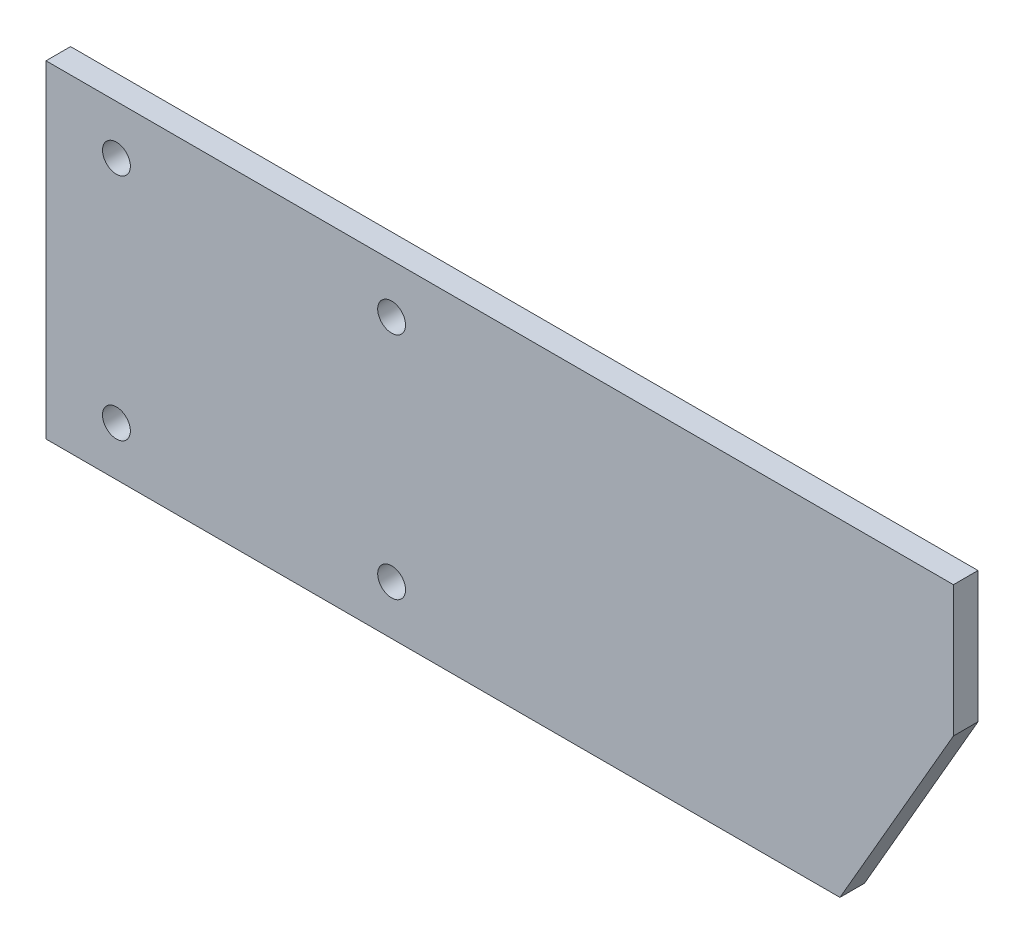
ISO-10303-21;
HEADER;
FILE_DESCRIPTION(('STEP AP214'),'2;1');
FILE_NAME('part.step','',(''),(''),'','','');
FILE_SCHEMA(('AUTOMOTIVE_DESIGN { 1 0 10303 214 1 1 1 1 }'));
ENDSEC;
DATA;
#1=APPLICATION_CONTEXT('core data for automotive mechanical design processes');
#2=APPLICATION_PROTOCOL_DEFINITION('international standard','automotive_design',2000,#1);
#3=PRODUCT_CONTEXT('',#1,'mechanical');
#4=PRODUCT('Part','Part','',(#3));
#5=PRODUCT_RELATED_PRODUCT_CATEGORY('part','',(#4));
#6=PRODUCT_DEFINITION_FORMATION('','',#4);
#7=PRODUCT_DEFINITION_CONTEXT('part definition',#1,'design');
#8=PRODUCT_DEFINITION('design','',#6,#7);
#9=PRODUCT_DEFINITION_SHAPE('','',#8);
#10=(LENGTH_UNIT() NAMED_UNIT(*) SI_UNIT(.MILLI.,.METRE.));
#11=(NAMED_UNIT(*) PLANE_ANGLE_UNIT() SI_UNIT($,.RADIAN.));
#12=(NAMED_UNIT(*) SI_UNIT($,.STERADIAN.) SOLID_ANGLE_UNIT());
#13=UNCERTAINTY_MEASURE_WITH_UNIT(LENGTH_MEASURE(1.E-05),#10,'distance_accuracy_value','');
#14=(GEOMETRIC_REPRESENTATION_CONTEXT(3) GLOBAL_UNCERTAINTY_ASSIGNED_CONTEXT((#13)) GLOBAL_UNIT_ASSIGNED_CONTEXT((#10,
#11,#12)) REPRESENTATION_CONTEXT('',''));
#15=CARTESIAN_POINT('',(0.,0.,0.));
#16=DIRECTION('',(0.,0.,1.));
#17=DIRECTION('',(1.,0.,0.));
#18=AXIS2_PLACEMENT_3D('',#15,#16,#17);
#19=CARTESIAN_POINT('',(-127.,-100.,15.));
#20=DIRECTION('',(0.,0.,1.));
#21=DIRECTION('',(1.,0.,0.));
#22=AXIS2_PLACEMENT_3D('',#19,#20,#21);
#23=PLANE('',#22);
#24=CARTESIAN_POINT('',(84.,-70.,15.));
#25=DIRECTION('',(0.,0.,1.));
#26=DIRECTION('',(1.,0.,0.));
#27=AXIS2_PLACEMENT_3D('',#24,#25,#26);
#28=CIRCLE('',#27,8.49999999999999);
#29=CARTESIAN_POINT('',(92.5,-70.,15.));
#30=VERTEX_POINT('',#29);
#31=EDGE_CURVE('E172',#30,#30,#28,.T.);
#32=ORIENTED_EDGE('',*,*,#31,.F.);
#33=EDGE_LOOP('',(#32));
#34=FACE_BOUND('',#33,.T.);
#35=CARTESIAN_POINT('',(-84.,70.,15.));
#36=DIRECTION('',(0.,0.,1.));
#37=DIRECTION('',(1.,0.,0.));
#38=AXIS2_PLACEMENT_3D('',#35,#36,#37);
#39=CIRCLE('',#38,8.50000000000001);
#40=CARTESIAN_POINT('',(-75.5,70.,15.));
#41=VERTEX_POINT('',#40);
#42=EDGE_CURVE('E111',#41,#41,#39,.T.);
#43=ORIENTED_EDGE('',*,*,#42,.F.);
#44=EDGE_LOOP('',(#43));
#45=FACE_BOUND('',#44,.T.);
#46=DIRECTION('',(0.,-1.,0.));
#47=VECTOR('',#46,1.);
#48=CARTESIAN_POINT('',(-127.,100.,15.));
#49=LINE('',#48,#47);
#50=CARTESIAN_POINT('',(-127.,100.,15.));
#51=VERTEX_POINT('',#50);
#52=CARTESIAN_POINT('',(-127.,-100.,15.));
#53=VERTEX_POINT('',#52);
#54=EDGE_CURVE('E116',#51,#53,#49,.T.);
#55=ORIENTED_EDGE('',*,*,#54,.T.);
#56=DIRECTION('',(1.,0.,0.));
#57=VECTOR('',#56,1.);
#58=CARTESIAN_POINT('',(-127.,-100.,15.));
#59=LINE('',#58,#57);
#60=CARTESIAN_POINT('',(357.717967697245,-100.,15.));
#61=VERTEX_POINT('',#60);
#62=EDGE_CURVE('E83',#53,#61,#59,.T.);
#63=ORIENTED_EDGE('',*,*,#62,.T.);
#64=DIRECTION('',(0.499999999999998,0.86602540378444,0.));
#65=VECTOR('',#64,1.);
#66=CARTESIAN_POINT('',(357.717967697245,-100.,15.));
#67=LINE('',#66,#65);
#68=CARTESIAN_POINT('',(427.,20.,15.));
#69=VERTEX_POINT('',#68);
#70=EDGE_CURVE('E87',#61,#69,#67,.T.);
#71=ORIENTED_EDGE('',*,*,#70,.T.);
#72=DIRECTION('',(0.,1.,0.));
#73=VECTOR('',#72,1.);
#74=CARTESIAN_POINT('',(427.,20.,15.));
#75=LINE('',#74,#73);
#76=CARTESIAN_POINT('',(427.,100.,15.));
#77=VERTEX_POINT('',#76);
#78=EDGE_CURVE('E91',#69,#77,#75,.T.);
#79=ORIENTED_EDGE('',*,*,#78,.T.);
#80=DIRECTION('',(-1.,0.,0.));
#81=VECTOR('',#80,1.);
#82=CARTESIAN_POINT('',(-127.,100.,15.));
#83=LINE('',#82,#81);
#84=EDGE_CURVE('E49',#77,#51,#83,.T.);
#85=ORIENTED_EDGE('',*,*,#84,.T.);
#86=EDGE_LOOP('',(#55,#63,#71,#79,#85));
#87=FACE_BOUND('',#86,.T.);
#88=CARTESIAN_POINT('',(84.,70.,15.));
#89=DIRECTION('',(0.,0.,1.));
#90=DIRECTION('',(1.,0.,0.));
#91=AXIS2_PLACEMENT_3D('',#88,#89,#90);
#92=CIRCLE('',#91,8.49999999999999);
#93=CARTESIAN_POINT('',(92.5,70.,15.));
#94=VERTEX_POINT('',#93);
#95=EDGE_CURVE('E178',#94,#94,#92,.T.);
#96=ORIENTED_EDGE('',*,*,#95,.F.);
#97=EDGE_LOOP('',(#96));
#98=FACE_BOUND('',#97,.T.);
#99=CARTESIAN_POINT('',(-84.,-70.,15.));
#100=DIRECTION('',(0.,0.,1.));
#101=DIRECTION('',(1.,0.,0.));
#102=AXIS2_PLACEMENT_3D('',#99,#100,#101);
#103=CIRCLE('',#102,8.50000000000001);
#104=CARTESIAN_POINT('',(-75.5,-70.,15.));
#105=VERTEX_POINT('',#104);
#106=EDGE_CURVE('E163',#105,#105,#103,.T.);
#107=ORIENTED_EDGE('',*,*,#106,.F.);
#108=EDGE_LOOP('',(#107));
#109=FACE_BOUND('',#108,.T.);
#110=ADVANCED_FACE('F32',(#34,#45,#87,#98,#109),#23,.T.);
#111=CARTESIAN_POINT('',(-127.,-100.,0.));
#112=DIRECTION('',(0.,0.,1.));
#113=DIRECTION('',(1.,0.,0.));
#114=AXIS2_PLACEMENT_3D('',#111,#112,#113);
#115=PLANE('',#114);
#116=CARTESIAN_POINT('',(84.,-70.,0.));
#117=DIRECTION('',(0.,0.,1.));
#118=DIRECTION('',(1.,0.,0.));
#119=AXIS2_PLACEMENT_3D('',#116,#117,#118);
#120=CIRCLE('',#119,8.49999999999999);
#121=CARTESIAN_POINT('',(92.5,-70.,0.));
#122=VERTEX_POINT('',#121);
#123=EDGE_CURVE('E169',#122,#122,#120,.T.);
#124=ORIENTED_EDGE('',*,*,#123,.T.);
#125=EDGE_LOOP('',(#124));
#126=FACE_BOUND('',#125,.T.);
#127=CARTESIAN_POINT('',(-84.,70.,0.));
#128=DIRECTION('',(0.,0.,1.));
#129=DIRECTION('',(1.,0.,0.));
#130=AXIS2_PLACEMENT_3D('',#127,#128,#129);
#131=CIRCLE('',#130,8.50000000000001);
#132=CARTESIAN_POINT('',(-75.5,70.,0.));
#133=VERTEX_POINT('',#132);
#134=EDGE_CURVE('E181',#133,#133,#131,.T.);
#135=ORIENTED_EDGE('',*,*,#134,.T.);
#136=EDGE_LOOP('',(#135));
#137=FACE_BOUND('',#136,.T.);
#138=DIRECTION('',(0.,-1.,0.));
#139=VECTOR('',#138,1.);
#140=CARTESIAN_POINT('',(-127.,100.,0.));
#141=LINE('',#140,#139);
#142=CARTESIAN_POINT('',(-127.,100.,0.));
#143=VERTEX_POINT('',#142);
#144=CARTESIAN_POINT('',(-127.,-100.,0.));
#145=VERTEX_POINT('',#144);
#146=EDGE_CURVE('E107',#143,#145,#141,.T.);
#147=ORIENTED_EDGE('',*,*,#146,.F.);
#148=DIRECTION('',(-1.,0.,0.));
#149=VECTOR('',#148,1.);
#150=CARTESIAN_POINT('',(-127.,100.,0.));
#151=LINE('',#150,#149);
#152=CARTESIAN_POINT('',(427.,100.,0.));
#153=VERTEX_POINT('',#152);
#154=EDGE_CURVE('E75',#153,#143,#151,.T.);
#155=ORIENTED_EDGE('',*,*,#154,.F.);
#156=DIRECTION('',(0.,1.,0.));
#157=VECTOR('',#156,1.);
#158=CARTESIAN_POINT('',(427.,20.,0.));
#159=LINE('',#158,#157);
#160=CARTESIAN_POINT('',(427.,20.,0.));
#161=VERTEX_POINT('',#160);
#162=EDGE_CURVE('E69',#161,#153,#159,.T.);
#163=ORIENTED_EDGE('',*,*,#162,.F.);
#164=DIRECTION('',(0.499999999999998,0.86602540378444,0.));
#165=VECTOR('',#164,1.);
#166=CARTESIAN_POINT('',(357.717967697245,-100.,0.));
#167=LINE('',#166,#165);
#168=CARTESIAN_POINT('',(357.717967697245,-100.,0.));
#169=VERTEX_POINT('',#168);
#170=EDGE_CURVE('E98',#169,#161,#167,.T.);
#171=ORIENTED_EDGE('',*,*,#170,.F.);
#172=DIRECTION('',(1.,0.,0.));
#173=VECTOR('',#172,1.);
#174=CARTESIAN_POINT('',(-127.,-100.,0.));
#175=LINE('',#174,#173);
#176=EDGE_CURVE('E110',#145,#169,#175,.T.);
#177=ORIENTED_EDGE('',*,*,#176,.F.);
#178=EDGE_LOOP('',(#147,#155,#163,#171,#177));
#179=FACE_BOUND('',#178,.T.);
#180=CARTESIAN_POINT('',(84.,70.,0.));
#181=DIRECTION('',(0.,0.,1.));
#182=DIRECTION('',(1.,0.,0.));
#183=AXIS2_PLACEMENT_3D('',#180,#181,#182);
#184=CIRCLE('',#183,8.49999999999999);
#185=CARTESIAN_POINT('',(92.5,70.,0.));
#186=VERTEX_POINT('',#185);
#187=EDGE_CURVE('E175',#186,#186,#184,.T.);
#188=ORIENTED_EDGE('',*,*,#187,.T.);
#189=EDGE_LOOP('',(#188));
#190=FACE_BOUND('',#189,.T.);
#191=CARTESIAN_POINT('',(-84.,-70.,0.));
#192=DIRECTION('',(0.,0.,1.));
#193=DIRECTION('',(1.,0.,0.));
#194=AXIS2_PLACEMENT_3D('',#191,#192,#193);
#195=CIRCLE('',#194,8.50000000000001);
#196=CARTESIAN_POINT('',(-75.5,-70.,0.));
#197=VERTEX_POINT('',#196);
#198=EDGE_CURVE('E166',#197,#197,#195,.T.);
#199=ORIENTED_EDGE('',*,*,#198,.T.);
#200=EDGE_LOOP('',(#199));
#201=FACE_BOUND('',#200,.T.);
#202=ADVANCED_FACE('F120',(#126,#137,#179,#190,#201),#115,.F.);
#203=CARTESIAN_POINT('',(-127.,100.,15.));
#204=DIRECTION('',(1.,0.,0.));
#205=DIRECTION('',(0.,1.,0.));
#206=AXIS2_PLACEMENT_3D('',#203,#204,#205);
#207=PLANE('',#206);
#208=ORIENTED_EDGE('',*,*,#146,.T.);
#209=DIRECTION('',(0.,0.,-1.));
#210=VECTOR('',#209,1.);
#211=CARTESIAN_POINT('',(-127.,-100.,15.));
#212=LINE('',#211,#210);
#213=EDGE_CURVE('E11',#53,#145,#212,.T.);
#214=ORIENTED_EDGE('',*,*,#213,.F.);
#215=ORIENTED_EDGE('',*,*,#54,.F.);
#216=DIRECTION('',(0.,0.,-1.));
#217=VECTOR('',#216,1.);
#218=CARTESIAN_POINT('',(-127.,100.,15.));
#219=LINE('',#218,#217);
#220=EDGE_CURVE('E103',#51,#143,#219,.T.);
#221=ORIENTED_EDGE('',*,*,#220,.T.);
#222=EDGE_LOOP('',(#208,#214,#215,#221));
#223=FACE_BOUND('',#222,.T.);
#224=ADVANCED_FACE('F34',(#223),#207,.F.);
#225=CARTESIAN_POINT('',(-127.,-100.,15.));
#226=DIRECTION('',(0.,1.,0.));
#227=DIRECTION('',(0.,0.,1.));
#228=AXIS2_PLACEMENT_3D('',#225,#226,#227);
#229=PLANE('',#228);
#230=ORIENTED_EDGE('',*,*,#176,.T.);
#231=DIRECTION('',(0.,0.,-1.));
#232=VECTOR('',#231,1.);
#233=CARTESIAN_POINT('',(357.717967697245,-100.,15.));
#234=LINE('',#233,#232);
#235=EDGE_CURVE('E41',#61,#169,#234,.T.);
#236=ORIENTED_EDGE('',*,*,#235,.F.);
#237=ORIENTED_EDGE('',*,*,#62,.F.);
#238=ORIENTED_EDGE('',*,*,#213,.T.);
#239=EDGE_LOOP('',(#230,#236,#237,#238));
#240=FACE_BOUND('',#239,.T.);
#241=ADVANCED_FACE('F229',(#240),#229,.F.);
#242=CARTESIAN_POINT('',(357.717967697245,-100.,15.));
#243=DIRECTION('',(-0.86602540378444,0.499999999999998,0.));
#244=DIRECTION('',(-0.499999999999998,-0.86602540378444,0.));
#245=AXIS2_PLACEMENT_3D('',#242,#243,#244);
#246=PLANE('',#245);
#247=ORIENTED_EDGE('',*,*,#170,.T.);
#248=DIRECTION('',(0.,0.,-1.));
#249=VECTOR('',#248,1.);
#250=CARTESIAN_POINT('',(427.,20.,15.));
#251=LINE('',#250,#249);
#252=EDGE_CURVE('E95',#69,#161,#251,.T.);
#253=ORIENTED_EDGE('',*,*,#252,.F.);
#254=ORIENTED_EDGE('',*,*,#70,.F.);
#255=ORIENTED_EDGE('',*,*,#235,.T.);
#256=EDGE_LOOP('',(#247,#253,#254,#255));
#257=FACE_BOUND('',#256,.T.);
#258=ADVANCED_FACE('F96',(#257),#246,.F.);
#259=CARTESIAN_POINT('',(427.,20.,15.));
#260=DIRECTION('',(-1.,0.,0.));
#261=DIRECTION('',(0.,0.,1.));
#262=AXIS2_PLACEMENT_3D('',#259,#260,#261);
#263=PLANE('',#262);
#264=ORIENTED_EDGE('',*,*,#162,.T.);
#265=DIRECTION('',(0.,0.,-1.));
#266=VECTOR('',#265,1.);
#267=CARTESIAN_POINT('',(427.,100.,15.));
#268=LINE('',#267,#266);
#269=EDGE_CURVE('E99',#77,#153,#268,.T.);
#270=ORIENTED_EDGE('',*,*,#269,.F.);
#271=ORIENTED_EDGE('',*,*,#78,.F.);
#272=ORIENTED_EDGE('',*,*,#252,.T.);
#273=EDGE_LOOP('',(#264,#270,#271,#272));
#274=FACE_BOUND('',#273,.T.);
#275=ADVANCED_FACE('F101',(#274),#263,.F.);
#276=CARTESIAN_POINT('',(-127.,100.,15.));
#277=DIRECTION('',(0.,-1.,0.));
#278=DIRECTION('',(0.,0.,-1.));
#279=AXIS2_PLACEMENT_3D('',#276,#277,#278);
#280=PLANE('',#279);
#281=ORIENTED_EDGE('',*,*,#154,.T.);
#282=ORIENTED_EDGE('',*,*,#220,.F.);
#283=ORIENTED_EDGE('',*,*,#84,.F.);
#284=ORIENTED_EDGE('',*,*,#269,.T.);
#285=EDGE_LOOP('',(#281,#282,#283,#284));
#286=FACE_BOUND('',#285,.T.);
#287=ADVANCED_FACE('F125',(#286),#280,.F.);
#288=CARTESIAN_POINT('',(-84.,70.,15.));
#289=DIRECTION('',(0.,0.,-1.));
#290=DIRECTION('',(-1.,0.,0.));
#291=AXIS2_PLACEMENT_3D('',#288,#289,#290);
#292=CYLINDRICAL_SURFACE('',#291,8.50000000000001);
#293=ORIENTED_EDGE('',*,*,#42,.T.);
#294=EDGE_LOOP('',(#293));
#295=FACE_BOUND('',#294,.T.);
#296=ORIENTED_EDGE('',*,*,#134,.F.);
#297=EDGE_LOOP('',(#296));
#298=FACE_BOUND('',#297,.T.);
#299=ADVANCED_FACE('F127',(#295,#298),#292,.F.);
#300=CARTESIAN_POINT('',(84.,70.,15.));
#301=DIRECTION('',(0.,0.,-1.));
#302=DIRECTION('',(-1.,0.,0.));
#303=AXIS2_PLACEMENT_3D('',#300,#301,#302);
#304=CYLINDRICAL_SURFACE('',#303,8.49999999999999);
#305=ORIENTED_EDGE('',*,*,#95,.T.);
#306=EDGE_LOOP('',(#305));
#307=FACE_BOUND('',#306,.T.);
#308=ORIENTED_EDGE('',*,*,#187,.F.);
#309=EDGE_LOOP('',(#308));
#310=FACE_BOUND('',#309,.T.);
#311=ADVANCED_FACE('F133',(#307,#310),#304,.F.);
#312=CARTESIAN_POINT('',(84.,-70.,15.));
#313=DIRECTION('',(0.,0.,-1.));
#314=DIRECTION('',(-1.,0.,0.));
#315=AXIS2_PLACEMENT_3D('',#312,#313,#314);
#316=CYLINDRICAL_SURFACE('',#315,8.49999999999999);
#317=ORIENTED_EDGE('',*,*,#31,.T.);
#318=EDGE_LOOP('',(#317));
#319=FACE_BOUND('',#318,.T.);
#320=ORIENTED_EDGE('',*,*,#123,.F.);
#321=EDGE_LOOP('',(#320));
#322=FACE_BOUND('',#321,.T.);
#323=ADVANCED_FACE('F150',(#319,#322),#316,.F.);
#324=CARTESIAN_POINT('',(-84.,-70.,15.));
#325=DIRECTION('',(0.,0.,-1.));
#326=DIRECTION('',(-1.,0.,0.));
#327=AXIS2_PLACEMENT_3D('',#324,#325,#326);
#328=CYLINDRICAL_SURFACE('',#327,8.50000000000001);
#329=ORIENTED_EDGE('',*,*,#106,.T.);
#330=EDGE_LOOP('',(#329));
#331=FACE_BOUND('',#330,.T.);
#332=ORIENTED_EDGE('',*,*,#198,.F.);
#333=EDGE_LOOP('',(#332));
#334=FACE_BOUND('',#333,.T.);
#335=ADVANCED_FACE('F154',(#331,#334),#328,.F.);
#336=CLOSED_SHELL('',(#110,#202,#224,#241,#258,#275,#287,#299,#311,#323,#335));
#337=MANIFOLD_SOLID_BREP('B2',#336);
#338=ADVANCED_BREP_SHAPE_REPRESENTATION('',(#18,#337),#14);
#339=SHAPE_DEFINITION_REPRESENTATION(#9,#338);
ENDSEC;
END-ISO-10303-21;
